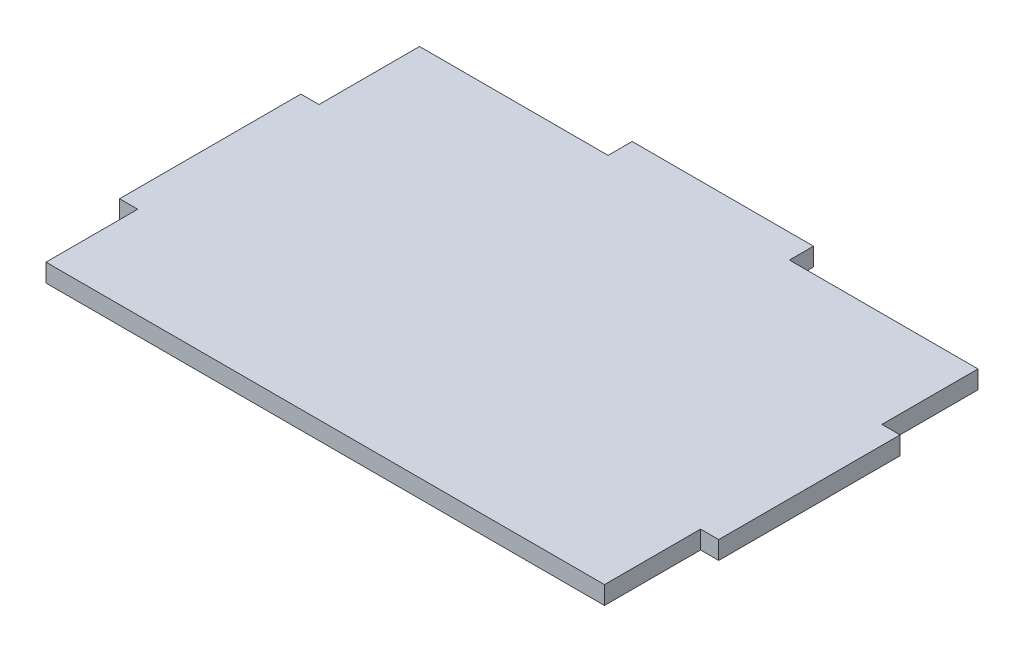
ISO-10303-21;
HEADER;
FILE_DESCRIPTION(('STEP AP214'),'2;1');
FILE_NAME('part.step','',(''),(''),'','','');
FILE_SCHEMA(('AUTOMOTIVE_DESIGN { 1 0 10303 214 1 1 1 1 }'));
ENDSEC;
DATA;
#1=APPLICATION_CONTEXT('core data for automotive mechanical design processes');
#2=APPLICATION_PROTOCOL_DEFINITION('international standard','automotive_design',2000,#1);
#3=PRODUCT_CONTEXT('',#1,'mechanical');
#4=PRODUCT('Part','Part','',(#3));
#5=PRODUCT_RELATED_PRODUCT_CATEGORY('part','',(#4));
#6=PRODUCT_DEFINITION_FORMATION('','',#4);
#7=PRODUCT_DEFINITION_CONTEXT('part definition',#1,'design');
#8=PRODUCT_DEFINITION('design','',#6,#7);
#9=PRODUCT_DEFINITION_SHAPE('','',#8);
#10=(LENGTH_UNIT() NAMED_UNIT(*) SI_UNIT(.MILLI.,.METRE.));
#11=(NAMED_UNIT(*) PLANE_ANGLE_UNIT() SI_UNIT($,.RADIAN.));
#12=(NAMED_UNIT(*) SI_UNIT($,.STERADIAN.) SOLID_ANGLE_UNIT());
#13=UNCERTAINTY_MEASURE_WITH_UNIT(LENGTH_MEASURE(1.E-05),#10,'distance_accuracy_value','');
#14=(GEOMETRIC_REPRESENTATION_CONTEXT(3) GLOBAL_UNCERTAINTY_ASSIGNED_CONTEXT((#13)) GLOBAL_UNIT_ASSIGNED_CONTEXT((#10,
#11,#12)) REPRESENTATION_CONTEXT('',''));
#15=CARTESIAN_POINT('',(0.,0.,0.));
#16=DIRECTION('',(0.,0.,1.));
#17=DIRECTION('',(1.,0.,0.));
#18=AXIS2_PLACEMENT_3D('',#15,#16,#17);
#19=CARTESIAN_POINT('',(25.,5.,-51.5));
#20=DIRECTION('',(0.,0.,1.));
#21=DIRECTION('',(1.,0.,0.));
#22=AXIS2_PLACEMENT_3D('',#19,#20,#21);
#23=PLANE('',#22);
#24=DIRECTION('',(-1.,0.,0.));
#25=VECTOR('',#24,1.);
#26=CARTESIAN_POINT('',(25.,0.,-51.5));
#27=LINE('',#26,#25);
#28=CARTESIAN_POINT('',(77.,0.,-51.5));
#29=VERTEX_POINT('',#28);
#30=CARTESIAN_POINT('',(25.,0.,-51.5));
#31=VERTEX_POINT('',#30);
#32=EDGE_CURVE('E177',#29,#31,#27,.T.);
#33=ORIENTED_EDGE('',*,*,#32,.T.);
#34=DIRECTION('',(0.,-1.,0.));
#35=VECTOR('',#34,1.);
#36=CARTESIAN_POINT('',(25.,5.,-51.5));
#37=LINE('',#36,#35);
#38=CARTESIAN_POINT('',(25.,5.,-51.5));
#39=VERTEX_POINT('',#38);
#40=EDGE_CURVE('E11',#39,#31,#37,.T.);
#41=ORIENTED_EDGE('',*,*,#40,.F.);
#42=DIRECTION('',(-1.,0.,0.));
#43=VECTOR('',#42,1.);
#44=CARTESIAN_POINT('',(25.,5.,-51.5));
#45=LINE('',#44,#43);
#46=CARTESIAN_POINT('',(77.,5.,-51.5));
#47=VERTEX_POINT('',#46);
#48=EDGE_CURVE('E207',#47,#39,#45,.T.);
#49=ORIENTED_EDGE('',*,*,#48,.F.);
#50=DIRECTION('',(0.,-1.,0.));
#51=VECTOR('',#50,1.);
#52=CARTESIAN_POINT('',(77.,5.,-51.5));
#53=LINE('',#52,#51);
#54=EDGE_CURVE('E173',#47,#29,#53,.T.);
#55=ORIENTED_EDGE('',*,*,#54,.T.);
#56=EDGE_LOOP('',(#33,#41,#49,#55));
#57=FACE_BOUND('',#56,.T.);
#58=ADVANCED_FACE('F33',(#57),#23,.F.);
#59=CARTESIAN_POINT('',(25.,5.,-51.5));
#60=DIRECTION('',(-1.,0.,0.));
#61=DIRECTION('',(0.,0.,1.));
#62=AXIS2_PLACEMENT_3D('',#59,#60,#61);
#63=PLANE('',#62);
#64=DIRECTION('',(0.,0.,-1.));
#65=VECTOR('',#64,1.);
#66=CARTESIAN_POINT('',(25.,0.,-51.5));
#67=LINE('',#66,#65);
#68=CARTESIAN_POINT('',(25.,0.,-58.1296760111734));
#69=VERTEX_POINT('',#68);
#70=EDGE_CURVE('E180',#31,#69,#67,.T.);
#71=ORIENTED_EDGE('',*,*,#70,.T.);
#72=DIRECTION('',(0.,-1.,0.));
#73=VECTOR('',#72,1.);
#74=CARTESIAN_POINT('',(25.,5.,-58.1296760111734));
#75=LINE('',#74,#73);
#76=CARTESIAN_POINT('',(25.,5.,-58.1296760111734));
#77=VERTEX_POINT('',#76);
#78=EDGE_CURVE('E41',#77,#69,#75,.T.);
#79=ORIENTED_EDGE('',*,*,#78,.F.);
#80=DIRECTION('',(0.,0.,-1.));
#81=VECTOR('',#80,1.);
#82=CARTESIAN_POINT('',(25.,5.,-51.5));
#83=LINE('',#82,#81);
#84=EDGE_CURVE('E116',#39,#77,#83,.T.);
#85=ORIENTED_EDGE('',*,*,#84,.F.);
#86=ORIENTED_EDGE('',*,*,#40,.T.);
#87=EDGE_LOOP('',(#71,#79,#85,#86));
#88=FACE_BOUND('',#87,.T.);
#89=ADVANCED_FACE('F305',(#88),#63,.F.);
#90=CARTESIAN_POINT('',(25.,5.,-58.1296760111734));
#91=DIRECTION('',(0.,0.,1.));
#92=DIRECTION('',(1.,0.,0.));
#93=AXIS2_PLACEMENT_3D('',#90,#91,#92);
#94=PLANE('',#93);
#95=DIRECTION('',(-1.,0.,0.));
#96=VECTOR('',#95,1.);
#97=CARTESIAN_POINT('',(25.,0.,-58.1296760111734));
#98=LINE('',#97,#96);
#99=CARTESIAN_POINT('',(-25.,0.,-58.1296760111733));
#100=VERTEX_POINT('',#99);
#101=EDGE_CURVE('E182',#69,#100,#98,.T.);
#102=ORIENTED_EDGE('',*,*,#101,.T.);
#103=DIRECTION('',(0.,-1.,0.));
#104=VECTOR('',#103,1.);
#105=CARTESIAN_POINT('',(-25.,5.,-58.1296760111733));
#106=LINE('',#105,#104);
#107=CARTESIAN_POINT('',(-25.,5.,-58.1296760111733));
#108=VERTEX_POINT('',#107);
#109=EDGE_CURVE('E238',#108,#100,#106,.T.);
#110=ORIENTED_EDGE('',*,*,#109,.F.);
#111=DIRECTION('',(-1.,0.,0.));
#112=VECTOR('',#111,1.);
#113=CARTESIAN_POINT('',(25.,5.,-58.1296760111734));
#114=LINE('',#113,#112);
#115=EDGE_CURVE('E246',#77,#108,#114,.T.);
#116=ORIENTED_EDGE('',*,*,#115,.F.);
#117=ORIENTED_EDGE('',*,*,#78,.T.);
#118=EDGE_LOOP('',(#102,#110,#116,#117));
#119=FACE_BOUND('',#118,.T.);
#120=ADVANCED_FACE('F244',(#119),#94,.F.);
#121=CARTESIAN_POINT('',(-25.,5.,-51.5));
#122=DIRECTION('',(1.,0.,0.));
#123=DIRECTION('',(0.,0.,-1.));
#124=AXIS2_PLACEMENT_3D('',#121,#122,#123);
#125=PLANE('',#124);
#126=DIRECTION('',(0.,0.,1.));
#127=VECTOR('',#126,1.);
#128=CARTESIAN_POINT('',(-25.,0.,-51.5));
#129=LINE('',#128,#127);
#130=CARTESIAN_POINT('',(-25.,0.,-51.5));
#131=VERTEX_POINT('',#130);
#132=EDGE_CURVE('E184',#100,#131,#129,.T.);
#133=ORIENTED_EDGE('',*,*,#132,.T.);
#134=DIRECTION('',(0.,-1.,0.));
#135=VECTOR('',#134,1.);
#136=CARTESIAN_POINT('',(-25.,5.,-51.5));
#137=LINE('',#136,#135);
#138=CARTESIAN_POINT('',(-25.,5.,-51.5));
#139=VERTEX_POINT('',#138);
#140=EDGE_CURVE('E235',#139,#131,#137,.T.);
#141=ORIENTED_EDGE('',*,*,#140,.F.);
#142=DIRECTION('',(0.,0.,1.));
#143=VECTOR('',#142,1.);
#144=CARTESIAN_POINT('',(-25.,5.,-51.5));
#145=LINE('',#144,#143);
#146=EDGE_CURVE('E264',#108,#139,#145,.T.);
#147=ORIENTED_EDGE('',*,*,#146,.F.);
#148=ORIENTED_EDGE('',*,*,#109,.T.);
#149=EDGE_LOOP('',(#133,#141,#147,#148));
#150=FACE_BOUND('',#149,.T.);
#151=ADVANCED_FACE('F255',(#150),#125,.F.);
#152=CARTESIAN_POINT('',(-25.,5.,-51.5));
#153=DIRECTION('',(0.,0.,1.));
#154=DIRECTION('',(1.,0.,0.));
#155=AXIS2_PLACEMENT_3D('',#152,#153,#154);
#156=PLANE('',#155);
#157=DIRECTION('',(-1.,0.,0.));
#158=VECTOR('',#157,1.);
#159=CARTESIAN_POINT('',(-25.,0.,-51.5));
#160=LINE('',#159,#158);
#161=CARTESIAN_POINT('',(-77.,0.,-51.5));
#162=VERTEX_POINT('',#161);
#163=EDGE_CURVE('E186',#131,#162,#160,.T.);
#164=ORIENTED_EDGE('',*,*,#163,.T.);
#165=DIRECTION('',(0.,-1.,0.));
#166=VECTOR('',#165,1.);
#167=CARTESIAN_POINT('',(-77.,5.,-51.5));
#168=LINE('',#167,#166);
#169=CARTESIAN_POINT('',(-77.,5.,-51.5));
#170=VERTEX_POINT('',#169);
#171=EDGE_CURVE('E232',#170,#162,#168,.T.);
#172=ORIENTED_EDGE('',*,*,#171,.F.);
#173=DIRECTION('',(-1.,0.,0.));
#174=VECTOR('',#173,1.);
#175=CARTESIAN_POINT('',(-25.,5.,-51.5));
#176=LINE('',#175,#174);
#177=EDGE_CURVE('E261',#139,#170,#176,.T.);
#178=ORIENTED_EDGE('',*,*,#177,.F.);
#179=ORIENTED_EDGE('',*,*,#140,.T.);
#180=EDGE_LOOP('',(#164,#172,#178,#179));
#181=FACE_BOUND('',#180,.T.);
#182=ADVANCED_FACE('F259',(#181),#156,.F.);
#183=CARTESIAN_POINT('',(-77.,5.,-23.7818675716787));
#184=DIRECTION('',(1.,0.,0.));
#185=DIRECTION('',(0.,0.,-1.));
#186=AXIS2_PLACEMENT_3D('',#183,#184,#185);
#187=PLANE('',#186);
#188=DIRECTION('',(0.,0.,1.));
#189=VECTOR('',#188,1.);
#190=CARTESIAN_POINT('',(-77.,0.,-23.7818675716787));
#191=LINE('',#190,#189);
#192=CARTESIAN_POINT('',(-77.,0.,-23.7818675716787));
#193=VERTEX_POINT('',#192);
#194=EDGE_CURVE('E188',#162,#193,#191,.T.);
#195=ORIENTED_EDGE('',*,*,#194,.T.);
#196=DIRECTION('',(0.,-1.,0.));
#197=VECTOR('',#196,1.);
#198=CARTESIAN_POINT('',(-77.,5.,-23.7818675716787));
#199=LINE('',#198,#197);
#200=CARTESIAN_POINT('',(-77.,5.,-23.7818675716787));
#201=VERTEX_POINT('',#200);
#202=EDGE_CURVE('E229',#201,#193,#199,.T.);
#203=ORIENTED_EDGE('',*,*,#202,.F.);
#204=DIRECTION('',(0.,0.,1.));
#205=VECTOR('',#204,1.);
#206=CARTESIAN_POINT('',(-77.,5.,-23.7818675716787));
#207=LINE('',#206,#205);
#208=EDGE_CURVE('E263',#170,#201,#207,.T.);
#209=ORIENTED_EDGE('',*,*,#208,.F.);
#210=ORIENTED_EDGE('',*,*,#171,.T.);
#211=EDGE_LOOP('',(#195,#203,#209,#210));
#212=FACE_BOUND('',#211,.T.);
#213=ADVANCED_FACE('F318',(#212),#187,.F.);
#214=CARTESIAN_POINT('',(-77.,5.,-23.7818675716787));
#215=DIRECTION('',(0.,0.,1.));
#216=DIRECTION('',(1.,0.,0.));
#217=AXIS2_PLACEMENT_3D('',#214,#215,#216);
#218=PLANE('',#217);
#219=DIRECTION('',(-1.,0.,0.));
#220=VECTOR('',#219,1.);
#221=CARTESIAN_POINT('',(-77.,0.,-23.7818675716787));
#222=LINE('',#221,#220);
#223=CARTESIAN_POINT('',(-82.,0.,-23.7818675716787));
#224=VERTEX_POINT('',#223);
#225=EDGE_CURVE('E190',#193,#224,#222,.T.);
#226=ORIENTED_EDGE('',*,*,#225,.T.);
#227=DIRECTION('',(0.,-1.,0.));
#228=VECTOR('',#227,1.);
#229=CARTESIAN_POINT('',(-82.,5.,-23.7818675716787));
#230=LINE('',#229,#228);
#231=CARTESIAN_POINT('',(-82.,5.,-23.7818675716787));
#232=VERTEX_POINT('',#231);
#233=EDGE_CURVE('E226',#232,#224,#230,.T.);
#234=ORIENTED_EDGE('',*,*,#233,.F.);
#235=DIRECTION('',(-1.,0.,0.));
#236=VECTOR('',#235,1.);
#237=CARTESIAN_POINT('',(-77.,5.,-23.7818675716787));
#238=LINE('',#237,#236);
#239=EDGE_CURVE('E266',#201,#232,#238,.T.);
#240=ORIENTED_EDGE('',*,*,#239,.F.);
#241=ORIENTED_EDGE('',*,*,#202,.T.);
#242=EDGE_LOOP('',(#226,#234,#240,#241));
#243=FACE_BOUND('',#242,.T.);
#244=ADVANCED_FACE('F321',(#243),#218,.F.);
#245=CARTESIAN_POINT('',(-82.,5.,26.2181324283213));
#246=DIRECTION('',(1.,0.,0.));
#247=DIRECTION('',(0.,0.,-1.));
#248=AXIS2_PLACEMENT_3D('',#245,#246,#247);
#249=PLANE('',#248);
#250=DIRECTION('',(0.,0.,1.));
#251=VECTOR('',#250,1.);
#252=CARTESIAN_POINT('',(-82.,0.,26.2181324283213));
#253=LINE('',#252,#251);
#254=CARTESIAN_POINT('',(-82.,0.,26.2181324283213));
#255=VERTEX_POINT('',#254);
#256=EDGE_CURVE('E192',#224,#255,#253,.T.);
#257=ORIENTED_EDGE('',*,*,#256,.T.);
#258=DIRECTION('',(0.,-1.,0.));
#259=VECTOR('',#258,1.);
#260=CARTESIAN_POINT('',(-82.,5.,26.2181324283213));
#261=LINE('',#260,#259);
#262=CARTESIAN_POINT('',(-82.,5.,26.2181324283213));
#263=VERTEX_POINT('',#262);
#264=EDGE_CURVE('E223',#263,#255,#261,.T.);
#265=ORIENTED_EDGE('',*,*,#264,.F.);
#266=DIRECTION('',(0.,0.,1.));
#267=VECTOR('',#266,1.);
#268=CARTESIAN_POINT('',(-82.,5.,26.2181324283213));
#269=LINE('',#268,#267);
#270=EDGE_CURVE('E272',#232,#263,#269,.T.);
#271=ORIENTED_EDGE('',*,*,#270,.F.);
#272=ORIENTED_EDGE('',*,*,#233,.T.);
#273=EDGE_LOOP('',(#257,#265,#271,#272));
#274=FACE_BOUND('',#273,.T.);
#275=ADVANCED_FACE('F325',(#274),#249,.F.);
#276=CARTESIAN_POINT('',(-77.,5.,26.2181324283213));
#277=DIRECTION('',(0.,0.,-1.));
#278=DIRECTION('',(-1.,0.,0.));
#279=AXIS2_PLACEMENT_3D('',#276,#277,#278);
#280=PLANE('',#279);
#281=DIRECTION('',(1.,0.,0.));
#282=VECTOR('',#281,1.);
#283=CARTESIAN_POINT('',(-77.,0.,26.2181324283213));
#284=LINE('',#283,#282);
#285=CARTESIAN_POINT('',(-77.,0.,26.2181324283213));
#286=VERTEX_POINT('',#285);
#287=EDGE_CURVE('E194',#255,#286,#284,.T.);
#288=ORIENTED_EDGE('',*,*,#287,.T.);
#289=DIRECTION('',(0.,-1.,0.));
#290=VECTOR('',#289,1.);
#291=CARTESIAN_POINT('',(-77.,5.,26.2181324283213));
#292=LINE('',#291,#290);
#293=CARTESIAN_POINT('',(-77.,5.,26.2181324283213));
#294=VERTEX_POINT('',#293);
#295=EDGE_CURVE('E220',#294,#286,#292,.T.);
#296=ORIENTED_EDGE('',*,*,#295,.F.);
#297=DIRECTION('',(1.,0.,0.));
#298=VECTOR('',#297,1.);
#299=CARTESIAN_POINT('',(-77.,5.,26.2181324283213));
#300=LINE('',#299,#298);
#301=EDGE_CURVE('E274',#263,#294,#300,.T.);
#302=ORIENTED_EDGE('',*,*,#301,.F.);
#303=ORIENTED_EDGE('',*,*,#264,.T.);
#304=EDGE_LOOP('',(#288,#296,#302,#303));
#305=FACE_BOUND('',#304,.T.);
#306=ADVANCED_FACE('F329',(#305),#280,.F.);
#307=CARTESIAN_POINT('',(-77.,5.,51.5));
#308=DIRECTION('',(1.,0.,0.));
#309=DIRECTION('',(0.,0.,-1.));
#310=AXIS2_PLACEMENT_3D('',#307,#308,#309);
#311=PLANE('',#310);
#312=DIRECTION('',(0.,0.,1.));
#313=VECTOR('',#312,1.);
#314=CARTESIAN_POINT('',(-77.,0.,51.5));
#315=LINE('',#314,#313);
#316=CARTESIAN_POINT('',(-77.,0.,51.5));
#317=VERTEX_POINT('',#316);
#318=EDGE_CURVE('E196',#286,#317,#315,.T.);
#319=ORIENTED_EDGE('',*,*,#318,.T.);
#320=DIRECTION('',(0.,-1.,0.));
#321=VECTOR('',#320,1.);
#322=CARTESIAN_POINT('',(-77.,5.,51.5));
#323=LINE('',#322,#321);
#324=CARTESIAN_POINT('',(-77.,5.,51.5));
#325=VERTEX_POINT('',#324);
#326=EDGE_CURVE('E217',#325,#317,#323,.T.);
#327=ORIENTED_EDGE('',*,*,#326,.F.);
#328=DIRECTION('',(0.,0.,1.));
#329=VECTOR('',#328,1.);
#330=CARTESIAN_POINT('',(-77.,5.,51.5));
#331=LINE('',#330,#329);
#332=EDGE_CURVE('E276',#294,#325,#331,.T.);
#333=ORIENTED_EDGE('',*,*,#332,.F.);
#334=ORIENTED_EDGE('',*,*,#295,.T.);
#335=EDGE_LOOP('',(#319,#327,#333,#334));
#336=FACE_BOUND('',#335,.T.);
#337=ADVANCED_FACE('F333',(#336),#311,.F.);
#338=CARTESIAN_POINT('',(-77.,5.,51.5));
#339=DIRECTION('',(0.,0.,-1.));
#340=DIRECTION('',(-1.,0.,0.));
#341=AXIS2_PLACEMENT_3D('',#338,#339,#340);
#342=PLANE('',#341);
#343=DIRECTION('',(1.,0.,0.));
#344=VECTOR('',#343,1.);
#345=CARTESIAN_POINT('',(-77.,0.,51.5));
#346=LINE('',#345,#344);
#347=CARTESIAN_POINT('',(77.,0.,51.5));
#348=VERTEX_POINT('',#347);
#349=EDGE_CURVE('E198',#317,#348,#346,.T.);
#350=ORIENTED_EDGE('',*,*,#349,.T.);
#351=DIRECTION('',(0.,-1.,0.));
#352=VECTOR('',#351,1.);
#353=CARTESIAN_POINT('',(77.,5.,51.5));
#354=LINE('',#353,#352);
#355=CARTESIAN_POINT('',(77.,5.,51.5));
#356=VERTEX_POINT('',#355);
#357=EDGE_CURVE('E214',#356,#348,#354,.T.);
#358=ORIENTED_EDGE('',*,*,#357,.F.);
#359=DIRECTION('',(1.,0.,0.));
#360=VECTOR('',#359,1.);
#361=CARTESIAN_POINT('',(-77.,5.,51.5));
#362=LINE('',#361,#360);
#363=EDGE_CURVE('E278',#325,#356,#362,.T.);
#364=ORIENTED_EDGE('',*,*,#363,.F.);
#365=ORIENTED_EDGE('',*,*,#326,.T.);
#366=EDGE_LOOP('',(#350,#358,#364,#365));
#367=FACE_BOUND('',#366,.T.);
#368=ADVANCED_FACE('F337',(#367),#342,.F.);
#369=CARTESIAN_POINT('',(77.,5.,51.5));
#370=DIRECTION('',(-1.,0.,0.));
#371=DIRECTION('',(0.,0.,1.));
#372=AXIS2_PLACEMENT_3D('',#369,#370,#371);
#373=PLANE('',#372);
#374=DIRECTION('',(0.,0.,-1.));
#375=VECTOR('',#374,1.);
#376=CARTESIAN_POINT('',(77.,0.,51.5));
#377=LINE('',#376,#375);
#378=CARTESIAN_POINT('',(77.,0.,25.));
#379=VERTEX_POINT('',#378);
#380=EDGE_CURVE('E200',#348,#379,#377,.T.);
#381=ORIENTED_EDGE('',*,*,#380,.T.);
#382=DIRECTION('',(0.,-1.,0.));
#383=VECTOR('',#382,1.);
#384=CARTESIAN_POINT('',(77.,5.,25.));
#385=LINE('',#384,#383);
#386=CARTESIAN_POINT('',(77.,5.,25.));
#387=VERTEX_POINT('',#386);
#388=EDGE_CURVE('E211',#387,#379,#385,.T.);
#389=ORIENTED_EDGE('',*,*,#388,.F.);
#390=DIRECTION('',(0.,0.,-1.));
#391=VECTOR('',#390,1.);
#392=CARTESIAN_POINT('',(77.,5.,51.5));
#393=LINE('',#392,#391);
#394=EDGE_CURVE('E280',#356,#387,#393,.T.);
#395=ORIENTED_EDGE('',*,*,#394,.F.);
#396=ORIENTED_EDGE('',*,*,#357,.T.);
#397=EDGE_LOOP('',(#381,#389,#395,#396));
#398=FACE_BOUND('',#397,.T.);
#399=ADVANCED_FACE('F286',(#398),#373,.F.);
#400=CARTESIAN_POINT('',(77.,5.,25.));
#401=DIRECTION('',(0.,0.,-1.));
#402=DIRECTION('',(-1.,0.,0.));
#403=AXIS2_PLACEMENT_3D('',#400,#401,#402);
#404=PLANE('',#403);
#405=DIRECTION('',(1.,0.,0.));
#406=VECTOR('',#405,1.);
#407=CARTESIAN_POINT('',(77.,0.,25.));
#408=LINE('',#407,#406);
#409=CARTESIAN_POINT('',(82.,0.,25.));
#410=VERTEX_POINT('',#409);
#411=EDGE_CURVE('E202',#379,#410,#408,.T.);
#412=ORIENTED_EDGE('',*,*,#411,.T.);
#413=DIRECTION('',(0.,-1.,0.));
#414=VECTOR('',#413,1.);
#415=CARTESIAN_POINT('',(82.,5.,25.));
#416=LINE('',#415,#414);
#417=CARTESIAN_POINT('',(82.,5.,25.));
#418=VERTEX_POINT('',#417);
#419=EDGE_CURVE('E168',#418,#410,#416,.T.);
#420=ORIENTED_EDGE('',*,*,#419,.F.);
#421=DIRECTION('',(1.,0.,0.));
#422=VECTOR('',#421,1.);
#423=CARTESIAN_POINT('',(77.,5.,25.));
#424=LINE('',#423,#422);
#425=EDGE_CURVE('E159',#387,#418,#424,.T.);
#426=ORIENTED_EDGE('',*,*,#425,.F.);
#427=ORIENTED_EDGE('',*,*,#388,.T.);
#428=EDGE_LOOP('',(#412,#420,#426,#427));
#429=FACE_BOUND('',#428,.T.);
#430=ADVANCED_FACE('F290',(#429),#404,.F.);
#431=CARTESIAN_POINT('',(82.,5.,25.));
#432=DIRECTION('',(-1.,0.,0.));
#433=DIRECTION('',(0.,0.,1.));
#434=AXIS2_PLACEMENT_3D('',#431,#432,#433);
#435=PLANE('',#434);
#436=DIRECTION('',(0.,0.,-1.));
#437=VECTOR('',#436,1.);
#438=CARTESIAN_POINT('',(82.,0.,25.));
#439=LINE('',#438,#437);
#440=CARTESIAN_POINT('',(82.,0.,-25.));
#441=VERTEX_POINT('',#440);
#442=EDGE_CURVE('E167',#410,#441,#439,.T.);
#443=ORIENTED_EDGE('',*,*,#442,.T.);
#444=DIRECTION('',(0.,-1.,0.));
#445=VECTOR('',#444,1.);
#446=CARTESIAN_POINT('',(82.,5.,-25.));
#447=LINE('',#446,#445);
#448=CARTESIAN_POINT('',(82.,5.,-25.));
#449=VERTEX_POINT('',#448);
#450=EDGE_CURVE('E164',#449,#441,#447,.T.);
#451=ORIENTED_EDGE('',*,*,#450,.F.);
#452=DIRECTION('',(0.,0.,-1.));
#453=VECTOR('',#452,1.);
#454=CARTESIAN_POINT('',(82.,5.,25.));
#455=LINE('',#454,#453);
#456=EDGE_CURVE('E153',#418,#449,#455,.T.);
#457=ORIENTED_EDGE('',*,*,#456,.F.);
#458=ORIENTED_EDGE('',*,*,#419,.T.);
#459=EDGE_LOOP('',(#443,#451,#457,#458));
#460=FACE_BOUND('',#459,.T.);
#461=ADVANCED_FACE('F165',(#460),#435,.F.);
#462=CARTESIAN_POINT('',(77.,5.,-25.));
#463=DIRECTION('',(0.,0.,1.));
#464=DIRECTION('',(1.,0.,0.));
#465=AXIS2_PLACEMENT_3D('',#462,#463,#464);
#466=PLANE('',#465);
#467=DIRECTION('',(-1.,0.,0.));
#468=VECTOR('',#467,1.);
#469=CARTESIAN_POINT('',(77.,0.,-25.));
#470=LINE('',#469,#468);
#471=CARTESIAN_POINT('',(77.,0.,-25.));
#472=VERTEX_POINT('',#471);
#473=EDGE_CURVE('E102',#441,#472,#470,.T.);
#474=ORIENTED_EDGE('',*,*,#473,.T.);
#475=DIRECTION('',(0.,-1.,0.));
#476=VECTOR('',#475,1.);
#477=CARTESIAN_POINT('',(77.,5.,-25.));
#478=LINE('',#477,#476);
#479=CARTESIAN_POINT('',(77.,5.,-25.));
#480=VERTEX_POINT('',#479);
#481=EDGE_CURVE('E169',#480,#472,#478,.T.);
#482=ORIENTED_EDGE('',*,*,#481,.F.);
#483=DIRECTION('',(-1.,0.,0.));
#484=VECTOR('',#483,1.);
#485=CARTESIAN_POINT('',(77.,5.,-25.));
#486=LINE('',#485,#484);
#487=EDGE_CURVE('E157',#449,#480,#486,.T.);
#488=ORIENTED_EDGE('',*,*,#487,.F.);
#489=ORIENTED_EDGE('',*,*,#450,.T.);
#490=EDGE_LOOP('',(#474,#482,#488,#489));
#491=FACE_BOUND('',#490,.T.);
#492=ADVANCED_FACE('F171',(#491),#466,.F.);
#493=CARTESIAN_POINT('',(77.,5.,-25.));
#494=DIRECTION('',(-1.,0.,0.));
#495=DIRECTION('',(0.,0.,1.));
#496=AXIS2_PLACEMENT_3D('',#493,#494,#495);
#497=PLANE('',#496);
#498=DIRECTION('',(0.,0.,-1.));
#499=VECTOR('',#498,1.);
#500=CARTESIAN_POINT('',(77.,0.,-25.));
#501=LINE('',#500,#499);
#502=EDGE_CURVE('E108',#472,#29,#501,.T.);
#503=ORIENTED_EDGE('',*,*,#502,.T.);
#504=ORIENTED_EDGE('',*,*,#54,.F.);
#505=DIRECTION('',(0.,0.,-1.));
#506=VECTOR('',#505,1.);
#507=CARTESIAN_POINT('',(77.,5.,-25.));
#508=LINE('',#507,#506);
#509=EDGE_CURVE('E49',#480,#47,#508,.T.);
#510=ORIENTED_EDGE('',*,*,#509,.F.);
#511=ORIENTED_EDGE('',*,*,#481,.T.);
#512=EDGE_LOOP('',(#503,#504,#510,#511));
#513=FACE_BOUND('',#512,.T.);
#514=ADVANCED_FACE('F294',(#513),#497,.F.);
#515=CARTESIAN_POINT('',(0.,5.,0.));
#516=DIRECTION('',(0.,1.,0.));
#517=DIRECTION('',(0.,0.,1.));
#518=AXIS2_PLACEMENT_3D('',#515,#516,#517);
#519=PLANE('',#518);
#520=ORIENTED_EDGE('',*,*,#48,.T.);
#521=ORIENTED_EDGE('',*,*,#84,.T.);
#522=ORIENTED_EDGE('',*,*,#115,.T.);
#523=ORIENTED_EDGE('',*,*,#146,.T.);
#524=ORIENTED_EDGE('',*,*,#177,.T.);
#525=ORIENTED_EDGE('',*,*,#208,.T.);
#526=ORIENTED_EDGE('',*,*,#239,.T.);
#527=ORIENTED_EDGE('',*,*,#270,.T.);
#528=ORIENTED_EDGE('',*,*,#301,.T.);
#529=ORIENTED_EDGE('',*,*,#332,.T.);
#530=ORIENTED_EDGE('',*,*,#363,.T.);
#531=ORIENTED_EDGE('',*,*,#394,.T.);
#532=ORIENTED_EDGE('',*,*,#425,.T.);
#533=ORIENTED_EDGE('',*,*,#456,.T.);
#534=ORIENTED_EDGE('',*,*,#487,.T.);
#535=ORIENTED_EDGE('',*,*,#509,.T.);
#536=EDGE_LOOP('',(#520,#521,#522,#523,#524,#525,#526,#527,#528,#529,#530,#531,#532,#533,#534,#535));
#537=FACE_BOUND('',#536,.T.);
#538=ADVANCED_FACE('F155',(#537),#519,.T.);
#539=CARTESIAN_POINT('',(0.,0.,0.));
#540=DIRECTION('',(0.,1.,0.));
#541=DIRECTION('',(0.,0.,1.));
#542=AXIS2_PLACEMENT_3D('',#539,#540,#541);
#543=PLANE('',#542);
#544=ORIENTED_EDGE('',*,*,#32,.F.);
#545=ORIENTED_EDGE('',*,*,#502,.F.);
#546=ORIENTED_EDGE('',*,*,#473,.F.);
#547=ORIENTED_EDGE('',*,*,#442,.F.);
#548=ORIENTED_EDGE('',*,*,#411,.F.);
#549=ORIENTED_EDGE('',*,*,#380,.F.);
#550=ORIENTED_EDGE('',*,*,#349,.F.);
#551=ORIENTED_EDGE('',*,*,#318,.F.);
#552=ORIENTED_EDGE('',*,*,#287,.F.);
#553=ORIENTED_EDGE('',*,*,#256,.F.);
#554=ORIENTED_EDGE('',*,*,#225,.F.);
#555=ORIENTED_EDGE('',*,*,#194,.F.);
#556=ORIENTED_EDGE('',*,*,#163,.F.);
#557=ORIENTED_EDGE('',*,*,#132,.F.);
#558=ORIENTED_EDGE('',*,*,#101,.F.);
#559=ORIENTED_EDGE('',*,*,#70,.F.);
#560=EDGE_LOOP('',(#544,#545,#546,#547,#548,#549,#550,#551,#552,#553,#554,#555,#556,#557,#558,#559));
#561=FACE_BOUND('',#560,.T.);
#562=ADVANCED_FACE('F250',(#561),#543,.F.);
#563=CLOSED_SHELL('',(#58,#89,#120,#151,#182,#213,#244,#275,#306,#337,#368,#399,#430,#461,#492,
#514,#538,#562));
#564=MANIFOLD_SOLID_BREP('B2',#563);
#565=ADVANCED_BREP_SHAPE_REPRESENTATION('',(#18,#564),#14);
#566=SHAPE_DEFINITION_REPRESENTATION(#9,#565);
ENDSEC;
END-ISO-10303-21;
